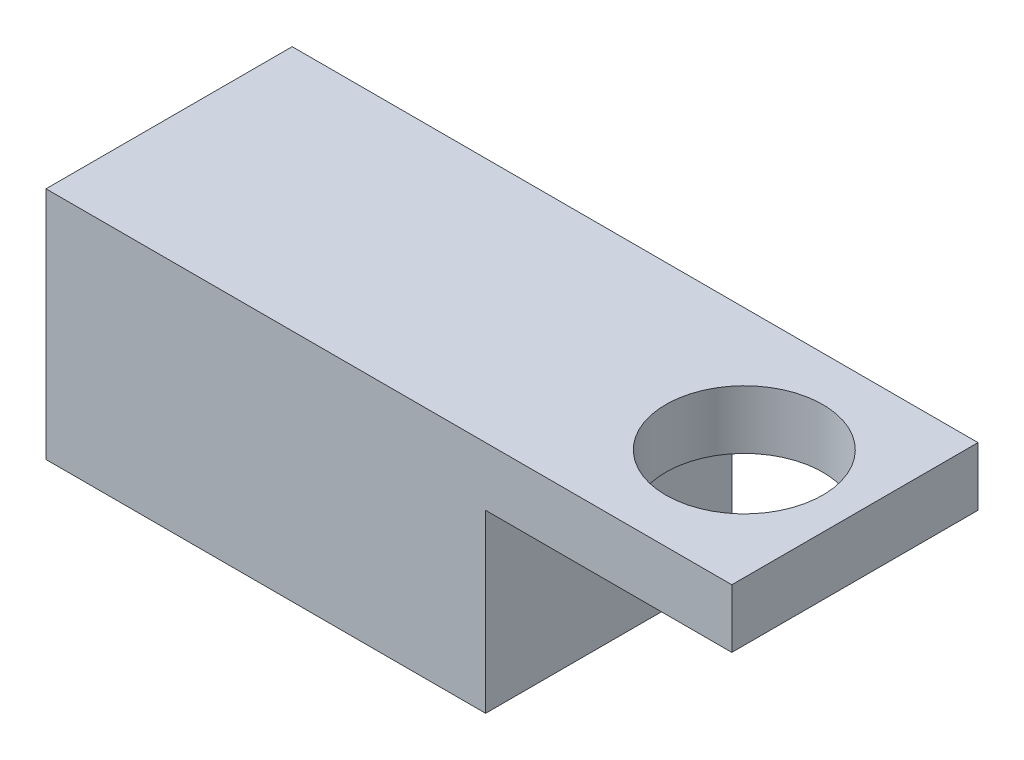
ISO-10303-21;
HEADER;
FILE_DESCRIPTION(('STEP AP214'),'2;1');
FILE_NAME('part.step','',(''),(''),'','','');
FILE_SCHEMA(('AUTOMOTIVE_DESIGN { 1 0 10303 214 1 1 1 1 }'));
ENDSEC;
DATA;
#1=APPLICATION_CONTEXT('core data for automotive mechanical design processes');
#2=APPLICATION_PROTOCOL_DEFINITION('international standard','automotive_design',2000,#1);
#3=PRODUCT_CONTEXT('',#1,'mechanical');
#4=PRODUCT('Part','Part','',(#3));
#5=PRODUCT_RELATED_PRODUCT_CATEGORY('part','',(#4));
#6=PRODUCT_DEFINITION_FORMATION('','',#4);
#7=PRODUCT_DEFINITION_CONTEXT('part definition',#1,'design');
#8=PRODUCT_DEFINITION('design','',#6,#7);
#9=PRODUCT_DEFINITION_SHAPE('','',#8);
#10=(LENGTH_UNIT() NAMED_UNIT(*) SI_UNIT(.MILLI.,.METRE.));
#11=(NAMED_UNIT(*) PLANE_ANGLE_UNIT() SI_UNIT($,.RADIAN.));
#12=(NAMED_UNIT(*) SI_UNIT($,.STERADIAN.) SOLID_ANGLE_UNIT());
#13=UNCERTAINTY_MEASURE_WITH_UNIT(LENGTH_MEASURE(1.E-05),#10,'distance_accuracy_value','');
#14=(GEOMETRIC_REPRESENTATION_CONTEXT(3) GLOBAL_UNCERTAINTY_ASSIGNED_CONTEXT((#13)) GLOBAL_UNIT_ASSIGNED_CONTEXT((#10,
#11,#12)) REPRESENTATION_CONTEXT('',''));
#15=CARTESIAN_POINT('',(0.,0.,0.));
#16=DIRECTION('',(0.,0.,1.));
#17=DIRECTION('',(1.,0.,0.));
#18=AXIS2_PLACEMENT_3D('',#15,#16,#17);
#19=CARTESIAN_POINT('',(14.859,10.16,5.334));
#20=DIRECTION('',(-1.,0.,0.));
#21=DIRECTION('',(0.,0.,1.));
#22=AXIS2_PLACEMENT_3D('',#19,#20,#21);
#23=PLANE('',#22);
#24=DIRECTION('',(0.,-1.,0.));
#25=VECTOR('',#24,1.);
#26=CARTESIAN_POINT('',(14.859,10.16,5.334));
#27=LINE('',#26,#25);
#28=CARTESIAN_POINT('',(14.859,10.16,5.334));
#29=VERTEX_POINT('',#28);
#30=CARTESIAN_POINT('',(14.859,7.62,5.334));
#31=VERTEX_POINT('',#30);
#32=EDGE_CURVE('E109',#29,#31,#27,.T.);
#33=ORIENTED_EDGE('',*,*,#32,.T.);
#34=DIRECTION('',(0.,0.,1.));
#35=VECTOR('',#34,1.);
#36=CARTESIAN_POINT('',(14.859,7.62,5.334));
#37=LINE('',#36,#35);
#38=CARTESIAN_POINT('',(14.859,7.62,-5.334));
#39=VERTEX_POINT('',#38);
#40=EDGE_CURVE('E94',#39,#31,#37,.T.);
#41=ORIENTED_EDGE('',*,*,#40,.F.);
#42=DIRECTION('',(0.,-1.,0.));
#43=VECTOR('',#42,1.);
#44=CARTESIAN_POINT('',(14.859,10.16,-5.334));
#45=LINE('',#44,#43);
#46=CARTESIAN_POINT('',(14.859,10.16,-5.334));
#47=VERTEX_POINT('',#46);
#48=EDGE_CURVE('E11',#47,#39,#45,.T.);
#49=ORIENTED_EDGE('',*,*,#48,.F.);
#50=DIRECTION('',(0.,0.,-1.));
#51=VECTOR('',#50,1.);
#52=CARTESIAN_POINT('',(14.859,10.16,5.334));
#53=LINE('',#52,#51);
#54=EDGE_CURVE('E113',#29,#47,#53,.T.);
#55=ORIENTED_EDGE('',*,*,#54,.F.);
#56=EDGE_LOOP('',(#33,#41,#49,#55));
#57=FACE_BOUND('',#56,.T.);
#58=ADVANCED_FACE('F32',(#57),#23,.F.);
#59=CARTESIAN_POINT('',(-14.859,10.16,-5.334));
#60=DIRECTION('',(0.,0.,1.));
#61=DIRECTION('',(1.,0.,0.));
#62=AXIS2_PLACEMENT_3D('',#59,#60,#61);
#63=PLANE('',#62);
#64=DIRECTION('',(1.,0.,0.));
#65=VECTOR('',#64,1.);
#66=CARTESIAN_POINT('',(14.859,7.62,-5.334));
#67=LINE('',#66,#65);
#68=CARTESIAN_POINT('',(4.191,7.62,-5.334));
#69=VERTEX_POINT('',#68);
#70=EDGE_CURVE('E100',#69,#39,#67,.T.);
#71=ORIENTED_EDGE('',*,*,#70,.F.);
#72=DIRECTION('',(0.,-1.,0.));
#73=VECTOR('',#72,1.);
#74=CARTESIAN_POINT('',(4.191,7.62,-5.334));
#75=LINE('',#74,#73);
#76=CARTESIAN_POINT('',(4.191,0.,-5.334));
#77=VERTEX_POINT('',#76);
#78=EDGE_CURVE('E129',#69,#77,#75,.T.);
#79=ORIENTED_EDGE('',*,*,#78,.T.);
#80=DIRECTION('',(-1.,0.,0.));
#81=VECTOR('',#80,1.);
#82=CARTESIAN_POINT('',(-14.859,0.,-5.334));
#83=LINE('',#82,#81);
#84=CARTESIAN_POINT('',(-14.859,0.,-5.334));
#85=VERTEX_POINT('',#84);
#86=EDGE_CURVE('E128',#77,#85,#83,.T.);
#87=ORIENTED_EDGE('',*,*,#86,.T.);
#88=DIRECTION('',(0.,-1.,0.));
#89=VECTOR('',#88,1.);
#90=CARTESIAN_POINT('',(-14.859,10.16,-5.334));
#91=LINE('',#90,#89);
#92=CARTESIAN_POINT('',(-14.859,10.16,-5.334));
#93=VERTEX_POINT('',#92);
#94=EDGE_CURVE('E39',#93,#85,#91,.T.);
#95=ORIENTED_EDGE('',*,*,#94,.F.);
#96=DIRECTION('',(-1.,0.,0.));
#97=VECTOR('',#96,1.);
#98=CARTESIAN_POINT('',(-14.859,10.16,-5.334));
#99=LINE('',#98,#97);
#100=EDGE_CURVE('E78',#47,#93,#99,.T.);
#101=ORIENTED_EDGE('',*,*,#100,.F.);
#102=ORIENTED_EDGE('',*,*,#48,.T.);
#103=EDGE_LOOP('',(#71,#79,#87,#95,#101,#102));
#104=FACE_BOUND('',#103,.T.);
#105=ADVANCED_FACE('F154',(#104),#63,.F.);
#106=CARTESIAN_POINT('',(-14.859,10.16,5.334));
#107=DIRECTION('',(1.,0.,0.));
#108=DIRECTION('',(0.,0.,-1.));
#109=AXIS2_PLACEMENT_3D('',#106,#107,#108);
#110=PLANE('',#109);
#111=DIRECTION('',(0.,0.,1.));
#112=VECTOR('',#111,1.);
#113=CARTESIAN_POINT('',(-14.859,0.,5.334));
#114=LINE('',#113,#112);
#115=CARTESIAN_POINT('',(-14.859,0.,5.334));
#116=VERTEX_POINT('',#115);
#117=EDGE_CURVE('E71',#85,#116,#114,.T.);
#118=ORIENTED_EDGE('',*,*,#117,.T.);
#119=DIRECTION('',(0.,-1.,0.));
#120=VECTOR('',#119,1.);
#121=CARTESIAN_POINT('',(-14.859,10.16,5.334));
#122=LINE('',#121,#120);
#123=CARTESIAN_POINT('',(-14.859,10.16,5.334));
#124=VERTEX_POINT('',#123);
#125=EDGE_CURVE('E114',#124,#116,#122,.T.);
#126=ORIENTED_EDGE('',*,*,#125,.F.);
#127=DIRECTION('',(0.,0.,1.));
#128=VECTOR('',#127,1.);
#129=CARTESIAN_POINT('',(-14.859,10.16,5.334));
#130=LINE('',#129,#128);
#131=EDGE_CURVE('E117',#93,#124,#130,.T.);
#132=ORIENTED_EDGE('',*,*,#131,.F.);
#133=ORIENTED_EDGE('',*,*,#94,.T.);
#134=EDGE_LOOP('',(#118,#126,#132,#133));
#135=FACE_BOUND('',#134,.T.);
#136=ADVANCED_FACE('F123',(#135),#110,.F.);
#137=CARTESIAN_POINT('',(-14.859,10.16,5.334));
#138=DIRECTION('',(0.,0.,-1.));
#139=DIRECTION('',(-1.,0.,0.));
#140=AXIS2_PLACEMENT_3D('',#137,#138,#139);
#141=PLANE('',#140);
#142=DIRECTION('',(1.,0.,0.));
#143=VECTOR('',#142,1.);
#144=CARTESIAN_POINT('',(-14.859,0.,5.334));
#145=LINE('',#144,#143);
#146=CARTESIAN_POINT('',(4.191,0.,5.334));
#147=VERTEX_POINT('',#146);
#148=EDGE_CURVE('E120',#116,#147,#145,.T.);
#149=ORIENTED_EDGE('',*,*,#148,.T.);
#150=DIRECTION('',(0.,-1.,0.));
#151=VECTOR('',#150,1.);
#152=CARTESIAN_POINT('',(4.191,7.62,5.334));
#153=LINE('',#152,#151);
#154=CARTESIAN_POINT('',(4.191,7.62,5.334));
#155=VERTEX_POINT('',#154);
#156=EDGE_CURVE('E46',#155,#147,#153,.T.);
#157=ORIENTED_EDGE('',*,*,#156,.F.);
#158=DIRECTION('',(-1.,0.,0.));
#159=VECTOR('',#158,1.);
#160=CARTESIAN_POINT('',(14.859,7.62,5.334));
#161=LINE('',#160,#159);
#162=EDGE_CURVE('E98',#31,#155,#161,.T.);
#163=ORIENTED_EDGE('',*,*,#162,.F.);
#164=ORIENTED_EDGE('',*,*,#32,.F.);
#165=DIRECTION('',(1.,0.,0.));
#166=VECTOR('',#165,1.);
#167=CARTESIAN_POINT('',(-14.859,10.16,5.334));
#168=LINE('',#167,#166);
#169=EDGE_CURVE('E55',#124,#29,#168,.T.);
#170=ORIENTED_EDGE('',*,*,#169,.F.);
#171=ORIENTED_EDGE('',*,*,#125,.T.);
#172=EDGE_LOOP('',(#149,#157,#163,#164,#170,#171));
#173=FACE_BOUND('',#172,.T.);
#174=ADVANCED_FACE('F108',(#173),#141,.F.);
#175=CARTESIAN_POINT('',(0.,10.16,0.));
#176=DIRECTION('',(0.,-1.,0.));
#177=DIRECTION('',(0.,0.,-1.));
#178=AXIS2_PLACEMENT_3D('',#175,#176,#177);
#179=PLANE('',#178);
#180=CARTESIAN_POINT('',(10.06602,10.16,0.));
#181=DIRECTION('',(0.,1.,0.));
#182=DIRECTION('',(0.,0.,1.));
#183=AXIS2_PLACEMENT_3D('',#180,#181,#182);
#184=CIRCLE('',#183,3.40159999999999);
#185=CARTESIAN_POINT('',(10.06602,10.16,3.40159999999999));
#186=VERTEX_POINT('',#185);
#187=EDGE_CURVE('E144',#186,#186,#184,.T.);
#188=ORIENTED_EDGE('',*,*,#187,.F.);
#189=EDGE_LOOP('',(#188));
#190=FACE_BOUND('',#189,.T.);
#191=ORIENTED_EDGE('',*,*,#54,.T.);
#192=ORIENTED_EDGE('',*,*,#100,.T.);
#193=ORIENTED_EDGE('',*,*,#131,.T.);
#194=ORIENTED_EDGE('',*,*,#169,.T.);
#195=EDGE_LOOP('',(#191,#192,#193,#194));
#196=FACE_BOUND('',#195,.T.);
#197=ADVANCED_FACE('F151',(#190,#196),#179,.F.);
#198=CARTESIAN_POINT('',(0.,0.,0.));
#199=DIRECTION('',(0.,-1.,0.));
#200=DIRECTION('',(0.,0.,-1.));
#201=AXIS2_PLACEMENT_3D('',#198,#199,#200);
#202=PLANE('',#201);
#203=DIRECTION('',(0.,0.,-1.));
#204=VECTOR('',#203,1.);
#205=CARTESIAN_POINT('',(4.191,0.,5.334));
#206=LINE('',#205,#204);
#207=EDGE_CURVE('E104',#147,#77,#206,.T.);
#208=ORIENTED_EDGE('',*,*,#207,.F.);
#209=ORIENTED_EDGE('',*,*,#148,.F.);
#210=ORIENTED_EDGE('',*,*,#117,.F.);
#211=ORIENTED_EDGE('',*,*,#86,.F.);
#212=EDGE_LOOP('',(#208,#209,#210,#211));
#213=FACE_BOUND('',#212,.T.);
#214=ADVANCED_FACE('F127',(#213),#202,.T.);
#215=CARTESIAN_POINT('',(4.191,7.62,5.334));
#216=DIRECTION('',(-1.,0.,0.));
#217=DIRECTION('',(0.,0.,1.));
#218=AXIS2_PLACEMENT_3D('',#215,#216,#217);
#219=PLANE('',#218);
#220=ORIENTED_EDGE('',*,*,#207,.T.);
#221=ORIENTED_EDGE('',*,*,#78,.F.);
#222=DIRECTION('',(0.,0.,-1.));
#223=VECTOR('',#222,1.);
#224=CARTESIAN_POINT('',(4.191,7.62,5.334));
#225=LINE('',#224,#223);
#226=EDGE_CURVE('E111',#155,#69,#225,.T.);
#227=ORIENTED_EDGE('',*,*,#226,.F.);
#228=ORIENTED_EDGE('',*,*,#156,.T.);
#229=EDGE_LOOP('',(#220,#221,#227,#228));
#230=FACE_BOUND('',#229,.T.);
#231=ADVANCED_FACE('F155',(#230),#219,.F.);
#232=CARTESIAN_POINT('',(0.,7.62,0.));
#233=DIRECTION('',(0.,1.,0.));
#234=DIRECTION('',(0.,0.,1.));
#235=AXIS2_PLACEMENT_3D('',#232,#233,#234);
#236=PLANE('',#235);
#237=CARTESIAN_POINT('',(10.06602,7.62,0.));
#238=DIRECTION('',(0.,1.,0.));
#239=DIRECTION('',(0.,0.,1.));
#240=AXIS2_PLACEMENT_3D('',#237,#238,#239);
#241=CIRCLE('',#240,3.40159999999999);
#242=CARTESIAN_POINT('',(10.06602,7.62,3.40159999999999));
#243=VERTEX_POINT('',#242);
#244=EDGE_CURVE('E139',#243,#243,#241,.T.);
#245=ORIENTED_EDGE('',*,*,#244,.T.);
#246=EDGE_LOOP('',(#245));
#247=FACE_BOUND('',#246,.T.);
#248=ORIENTED_EDGE('',*,*,#40,.T.);
#249=ORIENTED_EDGE('',*,*,#162,.T.);
#250=ORIENTED_EDGE('',*,*,#226,.T.);
#251=ORIENTED_EDGE('',*,*,#70,.T.);
#252=EDGE_LOOP('',(#248,#249,#250,#251));
#253=FACE_BOUND('',#252,.T.);
#254=ADVANCED_FACE('F96',(#247,#253),#236,.F.);
#255=CARTESIAN_POINT('',(10.06602,10.16,0.));
#256=DIRECTION('',(0.,1.,0.));
#257=DIRECTION('',(0.,0.,1.));
#258=AXIS2_PLACEMENT_3D('',#255,#256,#257);
#259=CYLINDRICAL_SURFACE('',#258,3.40159999999999);
#260=ORIENTED_EDGE('',*,*,#187,.T.);
#261=EDGE_LOOP('',(#260));
#262=FACE_BOUND('',#261,.T.);
#263=ORIENTED_EDGE('',*,*,#244,.F.);
#264=EDGE_LOOP('',(#263));
#265=FACE_BOUND('',#264,.T.);
#266=ADVANCED_FACE('F148',(#262,#265),#259,.F.);
#267=CLOSED_SHELL('',(#58,#105,#136,#174,#197,#214,#231,#254,#266));
#268=MANIFOLD_SOLID_BREP('B2',#267);
#269=ADVANCED_BREP_SHAPE_REPRESENTATION('',(#18,#268),#14);
#270=SHAPE_DEFINITION_REPRESENTATION(#9,#269);
ENDSEC;
END-ISO-10303-21;
